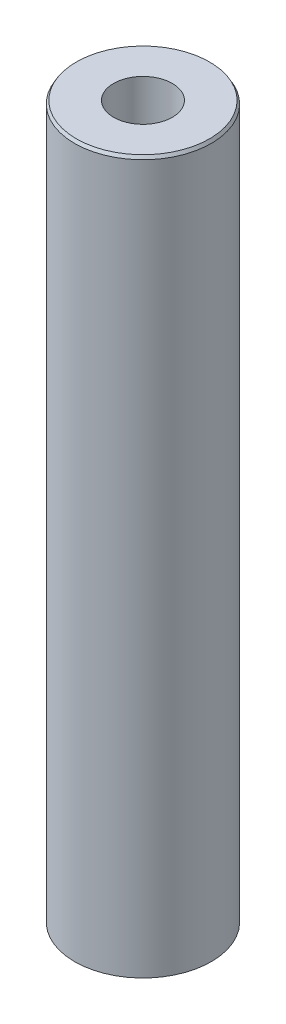
ISO-10303-21;
HEADER;
FILE_DESCRIPTION(('STEP AP214'),'2;1');
FILE_NAME('part.step','',(''),(''),'','','');
FILE_SCHEMA(('AUTOMOTIVE_DESIGN { 1 0 10303 214 1 1 1 1 }'));
ENDSEC;
DATA;
#1=APPLICATION_CONTEXT('core data for automotive mechanical design processes');
#2=APPLICATION_PROTOCOL_DEFINITION('international standard','automotive_design',2000,#1);
#3=PRODUCT_CONTEXT('',#1,'mechanical');
#4=PRODUCT('Part','Part','',(#3));
#5=PRODUCT_RELATED_PRODUCT_CATEGORY('part','',(#4));
#6=PRODUCT_DEFINITION_FORMATION('','',#4);
#7=PRODUCT_DEFINITION_CONTEXT('part definition',#1,'design');
#8=PRODUCT_DEFINITION('design','',#6,#7);
#9=PRODUCT_DEFINITION_SHAPE('','',#8);
#10=(LENGTH_UNIT() NAMED_UNIT(*) SI_UNIT(.MILLI.,.METRE.));
#11=(NAMED_UNIT(*) PLANE_ANGLE_UNIT() SI_UNIT($,.RADIAN.));
#12=(NAMED_UNIT(*) SI_UNIT($,.STERADIAN.) SOLID_ANGLE_UNIT());
#13=UNCERTAINTY_MEASURE_WITH_UNIT(LENGTH_MEASURE(1.E-05),#10,'distance_accuracy_value','');
#14=(GEOMETRIC_REPRESENTATION_CONTEXT(3) GLOBAL_UNCERTAINTY_ASSIGNED_CONTEXT((#13)) GLOBAL_UNIT_ASSIGNED_CONTEXT((#10,
#11,#12)) REPRESENTATION_CONTEXT('',''));
#15=CARTESIAN_POINT('',(0.,0.,0.));
#16=DIRECTION('',(0.,0.,1.));
#17=DIRECTION('',(1.,0.,0.));
#18=AXIS2_PLACEMENT_3D('',#15,#16,#17);
#19=CARTESIAN_POINT('',(0.,600.,0.));
#20=DIRECTION('',(0.,-1.,0.));
#21=DIRECTION('',(0.,0.,-1.));
#22=AXIS2_PLACEMENT_3D('',#19,#20,#21);
#23=CYLINDRICAL_SURFACE('',#22,57.5);
#24=CARTESIAN_POINT('',(0.,597.395571371991,0.));
#25=DIRECTION('',(0.,1.,0.));
#26=DIRECTION('',(0.,0.,1.));
#27=AXIS2_PLACEMENT_3D('',#24,#25,#26);
#28=CIRCLE('',#27,57.5);
#29=CARTESIAN_POINT('',(0.,597.395571371991,57.5));
#30=VERTEX_POINT('',#29);
#31=EDGE_CURVE('E50',#30,#30,#28,.F.);
#32=ORIENTED_EDGE('',*,*,#31,.T.);
#33=EDGE_LOOP('',(#32));
#34=FACE_BOUND('',#33,.T.);
#35=CARTESIAN_POINT('',(0.,1.50366756946607,0.));
#36=DIRECTION('',(0.,1.,0.));
#37=DIRECTION('',(0.,0.,1.));
#38=AXIS2_PLACEMENT_3D('',#35,#36,#37);
#39=CIRCLE('',#38,57.5);
#40=CARTESIAN_POINT('',(0.,1.50366756946607,57.5));
#41=VERTEX_POINT('',#40);
#42=EDGE_CURVE('E51',#41,#41,#39,.T.);
#43=ORIENTED_EDGE('',*,*,#42,.T.);
#44=EDGE_LOOP('',(#43));
#45=FACE_BOUND('',#44,.T.);
#46=ADVANCED_FACE('F39',(#34,#45),#23,.T.);
#47=CARTESIAN_POINT('',(0.,600.,0.));
#48=DIRECTION('',(0.,1.,0.));
#49=DIRECTION('',(0.,0.,1.));
#50=AXIS2_PLACEMENT_3D('',#47,#48,#49);
#51=PLANE('',#50);
#52=CARTESIAN_POINT('',(0.,600.,0.));
#53=DIRECTION('',(0.,1.,0.));
#54=DIRECTION('',(0.,0.,1.));
#55=AXIS2_PLACEMENT_3D('',#52,#53,#54);
#56=CIRCLE('',#55,55.9963324305339);
#57=CARTESIAN_POINT('',(0.,600.,55.9963324305339));
#58=VERTEX_POINT('',#57);
#59=EDGE_CURVE('E54',#58,#58,#56,.T.);
#60=ORIENTED_EDGE('',*,*,#59,.T.);
#61=EDGE_LOOP('',(#60));
#62=FACE_BOUND('',#61,.T.);
#63=CARTESIAN_POINT('',(0.,600.,0.));
#64=DIRECTION('',(0.,1.,0.));
#65=DIRECTION('',(0.,0.,1.));
#66=AXIS2_PLACEMENT_3D('',#63,#64,#65);
#67=CIRCLE('',#66,24.6937628219906);
#68=CARTESIAN_POINT('',(0.,600.,24.6937628219906));
#69=VERTEX_POINT('',#68);
#70=EDGE_CURVE('E58',#69,#69,#67,.T.);
#71=ORIENTED_EDGE('',*,*,#70,.F.);
#72=EDGE_LOOP('',(#71));
#73=FACE_BOUND('',#72,.T.);
#74=ADVANCED_FACE('F69',(#62,#73),#51,.T.);
#75=CARTESIAN_POINT('',(0.,0.,0.));
#76=DIRECTION('',(0.,1.,0.));
#77=DIRECTION('',(0.,0.,1.));
#78=AXIS2_PLACEMENT_3D('',#75,#76,#77);
#79=PLANE('',#78);
#80=CARTESIAN_POINT('',(0.,0.,0.));
#81=DIRECTION('',(0.,1.,0.));
#82=DIRECTION('',(0.,0.,1.));
#83=AXIS2_PLACEMENT_3D('',#80,#81,#82);
#84=CIRCLE('',#83,54.8955713719911);
#85=CARTESIAN_POINT('',(0.,0.,54.8955713719911));
#86=VERTEX_POINT('',#85);
#87=EDGE_CURVE('E10',#86,#86,#84,.F.);
#88=ORIENTED_EDGE('',*,*,#87,.T.);
#89=EDGE_LOOP('',(#88));
#90=FACE_BOUND('',#89,.T.);
#91=CARTESIAN_POINT('',(0.,0.,0.));
#92=DIRECTION('',(0.,1.,0.));
#93=DIRECTION('',(0.,0.,1.));
#94=AXIS2_PLACEMENT_3D('',#91,#92,#93);
#95=CIRCLE('',#94,24.6937628219906);
#96=CARTESIAN_POINT('',(0.,0.,24.6937628219906));
#97=VERTEX_POINT('',#96);
#98=EDGE_CURVE('E63',#97,#97,#95,.T.);
#99=ORIENTED_EDGE('',*,*,#98,.T.);
#100=EDGE_LOOP('',(#99));
#101=FACE_BOUND('',#100,.T.);
#102=ADVANCED_FACE('F75',(#90,#101),#79,.F.);
#103=CARTESIAN_POINT('',(0.,600.,0.));
#104=DIRECTION('',(0.,-1.,0.));
#105=DIRECTION('',(0.,0.,-1.));
#106=AXIS2_PLACEMENT_3D('',#103,#104,#105);
#107=CYLINDRICAL_SURFACE('',#106,24.6937628219906);
#108=ORIENTED_EDGE('',*,*,#70,.T.);
#109=EDGE_LOOP('',(#108));
#110=FACE_BOUND('',#109,.T.);
#111=ORIENTED_EDGE('',*,*,#98,.F.);
#112=EDGE_LOOP('',(#111));
#113=FACE_BOUND('',#112,.T.);
#114=ADVANCED_FACE('F70',(#110,#113),#107,.F.);
#115=CARTESIAN_POINT('',(0.,600.,0.));
#116=DIRECTION('',(0.,-1.,0.));
#117=DIRECTION('',(0.,0.,-1.));
#118=AXIS2_PLACEMENT_3D('',#115,#116,#117);
#119=CONICAL_SURFACE('',#118,55.9963324305339,0.523598775598307);
#120=ORIENTED_EDGE('',*,*,#31,.F.);
#121=EDGE_LOOP('',(#120));
#122=FACE_BOUND('',#121,.T.);
#123=ORIENTED_EDGE('',*,*,#59,.F.);
#124=EDGE_LOOP('',(#123));
#125=FACE_BOUND('',#124,.T.);
#126=ADVANCED_FACE('F81',(#122,#125),#119,.T.);
#127=CARTESIAN_POINT('',(0.,1.50366756946607,0.));
#128=DIRECTION('',(0.,1.,0.));
#129=DIRECTION('',(0.,0.,1.));
#130=AXIS2_PLACEMENT_3D('',#127,#128,#129);
#131=CONICAL_SURFACE('',#130,57.5,1.04719755119661);
#132=ORIENTED_EDGE('',*,*,#87,.F.);
#133=EDGE_LOOP('',(#132));
#134=FACE_BOUND('',#133,.T.);
#135=ORIENTED_EDGE('',*,*,#42,.F.);
#136=EDGE_LOOP('',(#135));
#137=FACE_BOUND('',#136,.T.);
#138=ADVANCED_FACE('F45',(#134,#137),#131,.T.);
#139=CLOSED_SHELL('',(#46,#74,#102,#114,#126,#138));
#140=MANIFOLD_SOLID_BREP('B2',#139);
#141=ADVANCED_BREP_SHAPE_REPRESENTATION('',(#18,#140),#14);
#142=SHAPE_DEFINITION_REPRESENTATION(#9,#141);
ENDSEC;
END-ISO-10303-21;
